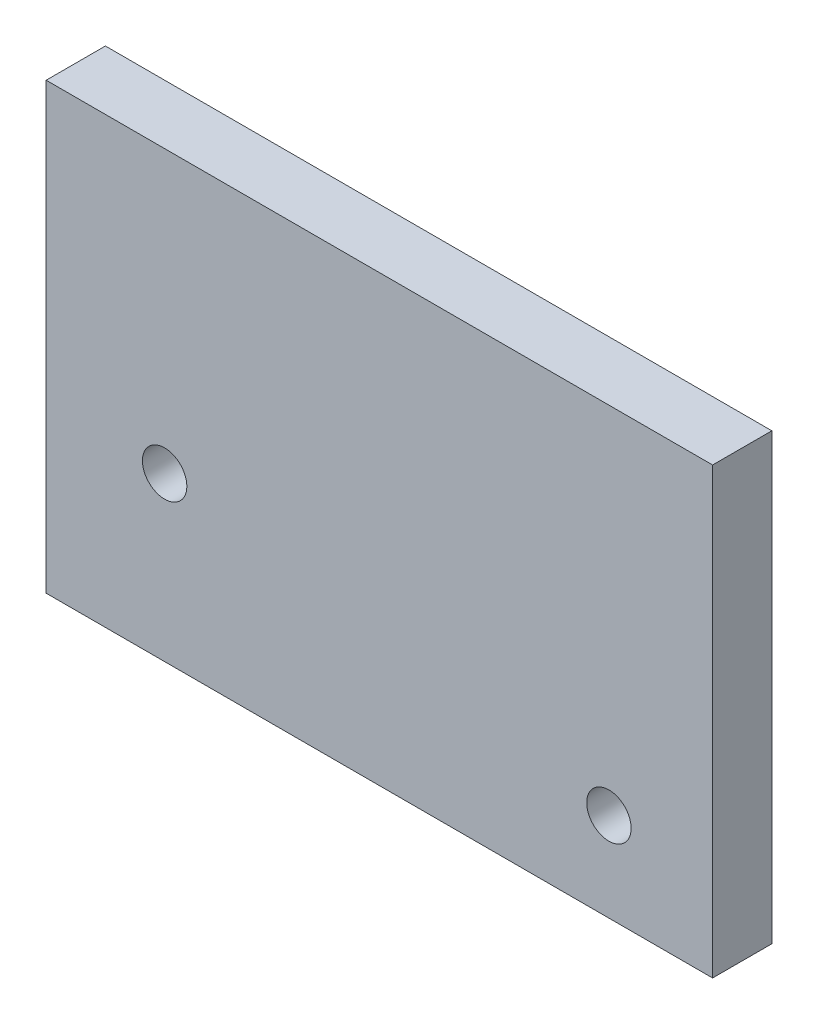
ISO-10303-21;
HEADER;
FILE_DESCRIPTION(('STEP AP214'),'2;1');
FILE_NAME('part.step','',(''),(''),'','','');
FILE_SCHEMA(('AUTOMOTIVE_DESIGN { 1 0 10303 214 1 1 1 1 }'));
ENDSEC;
DATA;
#1=APPLICATION_CONTEXT('core data for automotive mechanical design processes');
#2=APPLICATION_PROTOCOL_DEFINITION('international standard','automotive_design',2000,#1);
#3=PRODUCT_CONTEXT('',#1,'mechanical');
#4=PRODUCT('Part','Part','',(#3));
#5=PRODUCT_RELATED_PRODUCT_CATEGORY('part','',(#4));
#6=PRODUCT_DEFINITION_FORMATION('','',#4);
#7=PRODUCT_DEFINITION_CONTEXT('part definition',#1,'design');
#8=PRODUCT_DEFINITION('design','',#6,#7);
#9=PRODUCT_DEFINITION_SHAPE('','',#8);
#10=(LENGTH_UNIT() NAMED_UNIT(*) SI_UNIT(.MILLI.,.METRE.));
#11=(NAMED_UNIT(*) PLANE_ANGLE_UNIT() SI_UNIT($,.RADIAN.));
#12=(NAMED_UNIT(*) SI_UNIT($,.STERADIAN.) SOLID_ANGLE_UNIT());
#13=UNCERTAINTY_MEASURE_WITH_UNIT(LENGTH_MEASURE(1.E-05),#10,'distance_accuracy_value','');
#14=(GEOMETRIC_REPRESENTATION_CONTEXT(3) GLOBAL_UNCERTAINTY_ASSIGNED_CONTEXT((#13)) GLOBAL_UNIT_ASSIGNED_CONTEXT((#10,
#11,#12)) REPRESENTATION_CONTEXT('',''));
#15=CARTESIAN_POINT('',(0.,0.,0.));
#16=DIRECTION('',(0.,0.,1.));
#17=DIRECTION('',(1.,0.,0.));
#18=AXIS2_PLACEMENT_3D('',#15,#16,#17);
#19=CARTESIAN_POINT('',(0.,0.,4.));
#20=DIRECTION('',(0.,0.,-1.));
#21=DIRECTION('',(-1.,0.,0.));
#22=AXIS2_PLACEMENT_3D('',#19,#20,#21);
#23=PLANE('',#22);
#24=DIRECTION('',(0.,-1.,0.));
#25=VECTOR('',#24,1.);
#26=CARTESIAN_POINT('',(0.,0.,4.));
#27=LINE('',#26,#25);
#28=CARTESIAN_POINT('',(0.,30.,4.));
#29=VERTEX_POINT('',#28);
#30=CARTESIAN_POINT('',(0.,0.,4.));
#31=VERTEX_POINT('',#30);
#32=EDGE_CURVE('E89',#29,#31,#27,.T.);
#33=ORIENTED_EDGE('',*,*,#32,.T.);
#34=DIRECTION('',(1.,0.,0.));
#35=VECTOR('',#34,1.);
#36=CARTESIAN_POINT('',(0.,0.,4.));
#37=LINE('',#36,#35);
#38=CARTESIAN_POINT('',(45.,0.,4.));
#39=VERTEX_POINT('',#38);
#40=EDGE_CURVE('E84',#31,#39,#37,.T.);
#41=ORIENTED_EDGE('',*,*,#40,.T.);
#42=DIRECTION('',(0.,1.,0.));
#43=VECTOR('',#42,1.);
#44=CARTESIAN_POINT('',(45.,0.,4.));
#45=LINE('',#44,#43);
#46=CARTESIAN_POINT('',(45.,30.,4.));
#47=VERTEX_POINT('',#46);
#48=EDGE_CURVE('E87',#39,#47,#45,.T.);
#49=ORIENTED_EDGE('',*,*,#48,.T.);
#50=DIRECTION('',(-1.,0.,0.));
#51=VECTOR('',#50,1.);
#52=CARTESIAN_POINT('',(0.,30.,4.));
#53=LINE('',#52,#51);
#54=EDGE_CURVE('E54',#47,#29,#53,.T.);
#55=ORIENTED_EDGE('',*,*,#54,.T.);
#56=EDGE_LOOP('',(#33,#41,#49,#55));
#57=FACE_BOUND('',#56,.T.);
#58=CARTESIAN_POINT('',(38.,6.,4.));
#59=DIRECTION('',(0.,0.,1.));
#60=DIRECTION('',(1.,0.,0.));
#61=AXIS2_PLACEMENT_3D('',#58,#59,#60);
#62=CIRCLE('',#61,1.5);
#63=CARTESIAN_POINT('',(39.5,6.,4.));
#64=VERTEX_POINT('',#63);
#65=EDGE_CURVE('E104',#64,#64,#62,.T.);
#66=ORIENTED_EDGE('',*,*,#65,.F.);
#67=EDGE_LOOP('',(#66));
#68=FACE_BOUND('',#67,.T.);
#69=CARTESIAN_POINT('',(8.,11.,4.));
#70=DIRECTION('',(0.,0.,1.));
#71=DIRECTION('',(1.,0.,0.));
#72=AXIS2_PLACEMENT_3D('',#69,#70,#71);
#73=CIRCLE('',#72,1.5);
#74=CARTESIAN_POINT('',(9.5,11.,4.));
#75=VERTEX_POINT('',#74);
#76=EDGE_CURVE('E119',#75,#75,#73,.T.);
#77=ORIENTED_EDGE('',*,*,#76,.F.);
#78=EDGE_LOOP('',(#77));
#79=FACE_BOUND('',#78,.T.);
#80=ADVANCED_FACE('F37',(#57,#68,#79),#23,.F.);
#81=CARTESIAN_POINT('',(0.,0.,0.));
#82=DIRECTION('',(0.,0.,-1.));
#83=DIRECTION('',(-1.,0.,0.));
#84=AXIS2_PLACEMENT_3D('',#81,#82,#83);
#85=PLANE('',#84);
#86=CARTESIAN_POINT('',(38.,6.,0.));
#87=DIRECTION('',(0.,0.,1.));
#88=DIRECTION('',(1.,0.,0.));
#89=AXIS2_PLACEMENT_3D('',#86,#87,#88);
#90=CIRCLE('',#89,1.5);
#91=CARTESIAN_POINT('',(39.5,6.,0.));
#92=VERTEX_POINT('',#91);
#93=EDGE_CURVE('E116',#92,#92,#90,.T.);
#94=ORIENTED_EDGE('',*,*,#93,.T.);
#95=EDGE_LOOP('',(#94));
#96=FACE_BOUND('',#95,.T.);
#97=DIRECTION('',(0.,-1.,0.));
#98=VECTOR('',#97,1.);
#99=CARTESIAN_POINT('',(0.,0.,0.));
#100=LINE('',#99,#98);
#101=CARTESIAN_POINT('',(0.,30.,0.));
#102=VERTEX_POINT('',#101);
#103=CARTESIAN_POINT('',(0.,0.,0.));
#104=VERTEX_POINT('',#103);
#105=EDGE_CURVE('E101',#102,#104,#100,.T.);
#106=ORIENTED_EDGE('',*,*,#105,.F.);
#107=DIRECTION('',(-1.,0.,0.));
#108=VECTOR('',#107,1.);
#109=CARTESIAN_POINT('',(0.,30.,0.));
#110=LINE('',#109,#108);
#111=CARTESIAN_POINT('',(45.,30.,0.));
#112=VERTEX_POINT('',#111);
#113=EDGE_CURVE('E77',#112,#102,#110,.T.);
#114=ORIENTED_EDGE('',*,*,#113,.F.);
#115=DIRECTION('',(0.,1.,0.));
#116=VECTOR('',#115,1.);
#117=CARTESIAN_POINT('',(45.,0.,0.));
#118=LINE('',#117,#116);
#119=CARTESIAN_POINT('',(45.,0.,0.));
#120=VERTEX_POINT('',#119);
#121=EDGE_CURVE('E71',#120,#112,#118,.T.);
#122=ORIENTED_EDGE('',*,*,#121,.F.);
#123=DIRECTION('',(1.,0.,0.));
#124=VECTOR('',#123,1.);
#125=CARTESIAN_POINT('',(0.,0.,0.));
#126=LINE('',#125,#124);
#127=EDGE_CURVE('E93',#104,#120,#126,.T.);
#128=ORIENTED_EDGE('',*,*,#127,.F.);
#129=EDGE_LOOP('',(#106,#114,#122,#128));
#130=FACE_BOUND('',#129,.T.);
#131=CARTESIAN_POINT('',(8.,11.,0.));
#132=DIRECTION('',(0.,0.,1.));
#133=DIRECTION('',(1.,0.,0.));
#134=AXIS2_PLACEMENT_3D('',#131,#132,#133);
#135=CIRCLE('',#134,1.5);
#136=CARTESIAN_POINT('',(9.5,11.,0.));
#137=VERTEX_POINT('',#136);
#138=EDGE_CURVE('E122',#137,#137,#135,.T.);
#139=ORIENTED_EDGE('',*,*,#138,.T.);
#140=EDGE_LOOP('',(#139));
#141=FACE_BOUND('',#140,.T.);
#142=ADVANCED_FACE('F112',(#96,#130,#141),#85,.T.);
#143=CARTESIAN_POINT('',(0.,0.,4.));
#144=DIRECTION('',(1.,0.,0.));
#145=DIRECTION('',(0.,0.,-1.));
#146=AXIS2_PLACEMENT_3D('',#143,#144,#145);
#147=PLANE('',#146);
#148=ORIENTED_EDGE('',*,*,#105,.T.);
#149=DIRECTION('',(0.,0.,-1.));
#150=VECTOR('',#149,1.);
#151=CARTESIAN_POINT('',(0.,0.,4.));
#152=LINE('',#151,#150);
#153=EDGE_CURVE('E11',#31,#104,#152,.T.);
#154=ORIENTED_EDGE('',*,*,#153,.F.);
#155=ORIENTED_EDGE('',*,*,#32,.F.);
#156=DIRECTION('',(0.,0.,-1.));
#157=VECTOR('',#156,1.);
#158=CARTESIAN_POINT('',(0.,30.,4.));
#159=LINE('',#158,#157);
#160=EDGE_CURVE('E97',#29,#102,#159,.T.);
#161=ORIENTED_EDGE('',*,*,#160,.T.);
#162=EDGE_LOOP('',(#148,#154,#155,#161));
#163=FACE_BOUND('',#162,.T.);
#164=ADVANCED_FACE('F39',(#163),#147,.F.);
#165=CARTESIAN_POINT('',(0.,0.,4.));
#166=DIRECTION('',(0.,1.,0.));
#167=DIRECTION('',(0.,0.,1.));
#168=AXIS2_PLACEMENT_3D('',#165,#166,#167);
#169=PLANE('',#168);
#170=ORIENTED_EDGE('',*,*,#127,.T.);
#171=DIRECTION('',(0.,0.,-1.));
#172=VECTOR('',#171,1.);
#173=CARTESIAN_POINT('',(45.,0.,4.));
#174=LINE('',#173,#172);
#175=EDGE_CURVE('E46',#39,#120,#174,.T.);
#176=ORIENTED_EDGE('',*,*,#175,.F.);
#177=ORIENTED_EDGE('',*,*,#40,.F.);
#178=ORIENTED_EDGE('',*,*,#153,.T.);
#179=EDGE_LOOP('',(#170,#176,#177,#178));
#180=FACE_BOUND('',#179,.T.);
#181=ADVANCED_FACE('F92',(#180),#169,.F.);
#182=CARTESIAN_POINT('',(45.,0.,4.));
#183=DIRECTION('',(-1.,0.,0.));
#184=DIRECTION('',(0.,0.,1.));
#185=AXIS2_PLACEMENT_3D('',#182,#183,#184);
#186=PLANE('',#185);
#187=ORIENTED_EDGE('',*,*,#121,.T.);
#188=DIRECTION('',(0.,0.,-1.));
#189=VECTOR('',#188,1.);
#190=CARTESIAN_POINT('',(45.,30.,4.));
#191=LINE('',#190,#189);
#192=EDGE_CURVE('E94',#47,#112,#191,.T.);
#193=ORIENTED_EDGE('',*,*,#192,.F.);
#194=ORIENTED_EDGE('',*,*,#48,.F.);
#195=ORIENTED_EDGE('',*,*,#175,.T.);
#196=EDGE_LOOP('',(#187,#193,#194,#195));
#197=FACE_BOUND('',#196,.T.);
#198=ADVANCED_FACE('F95',(#197),#186,.F.);
#199=CARTESIAN_POINT('',(0.,30.,4.));
#200=DIRECTION('',(0.,-1.,0.));
#201=DIRECTION('',(0.,0.,-1.));
#202=AXIS2_PLACEMENT_3D('',#199,#200,#201);
#203=PLANE('',#202);
#204=ORIENTED_EDGE('',*,*,#113,.T.);
#205=ORIENTED_EDGE('',*,*,#160,.F.);
#206=ORIENTED_EDGE('',*,*,#54,.F.);
#207=ORIENTED_EDGE('',*,*,#192,.T.);
#208=EDGE_LOOP('',(#204,#205,#206,#207));
#209=FACE_BOUND('',#208,.T.);
#210=ADVANCED_FACE('F109',(#209),#203,.F.);
#211=CARTESIAN_POINT('',(38.,6.,4.));
#212=DIRECTION('',(0.,0.,-1.));
#213=DIRECTION('',(-1.,0.,0.));
#214=AXIS2_PLACEMENT_3D('',#211,#212,#213);
#215=CYLINDRICAL_SURFACE('',#214,1.5);
#216=ORIENTED_EDGE('',*,*,#65,.T.);
#217=EDGE_LOOP('',(#216));
#218=FACE_BOUND('',#217,.T.);
#219=ORIENTED_EDGE('',*,*,#93,.F.);
#220=EDGE_LOOP('',(#219));
#221=FACE_BOUND('',#220,.T.);
#222=ADVANCED_FACE('F139',(#218,#221),#215,.F.);
#223=CARTESIAN_POINT('',(8.,11.,4.));
#224=DIRECTION('',(0.,0.,-1.));
#225=DIRECTION('',(-1.,0.,0.));
#226=AXIS2_PLACEMENT_3D('',#223,#224,#225);
#227=CYLINDRICAL_SURFACE('',#226,1.5);
#228=ORIENTED_EDGE('',*,*,#76,.T.);
#229=EDGE_LOOP('',(#228));
#230=FACE_BOUND('',#229,.T.);
#231=ORIENTED_EDGE('',*,*,#138,.F.);
#232=EDGE_LOOP('',(#231));
#233=FACE_BOUND('',#232,.T.);
#234=ADVANCED_FACE('F128',(#230,#233),#227,.F.);
#235=CLOSED_SHELL('',(#80,#142,#164,#181,#198,#210,#222,#234));
#236=MANIFOLD_SOLID_BREP('B2',#235);
#237=ADVANCED_BREP_SHAPE_REPRESENTATION('',(#18,#236),#14);
#238=SHAPE_DEFINITION_REPRESENTATION(#9,#237);
ENDSEC;
END-ISO-10303-21;
